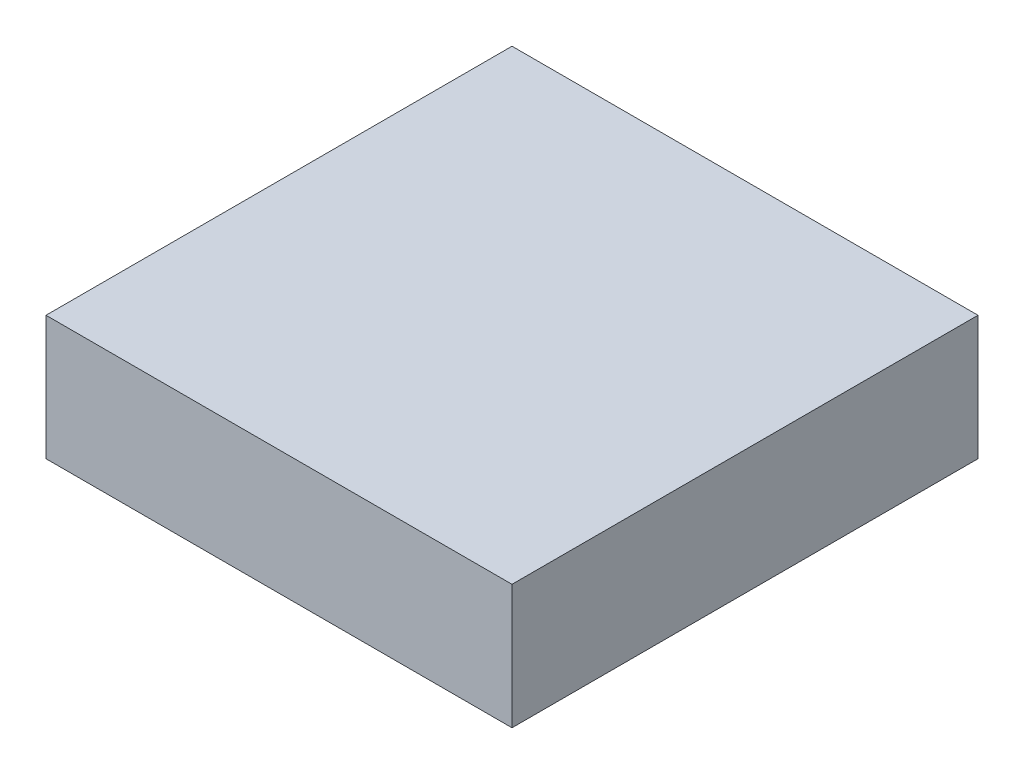
ISO-10303-21;
HEADER;
FILE_DESCRIPTION(('STEP AP214'),'2;1');
FILE_NAME('part.step','',(''),(''),'','','');
FILE_SCHEMA(('AUTOMOTIVE_DESIGN { 1 0 10303 214 1 1 1 1 }'));
ENDSEC;
DATA;
#1=APPLICATION_CONTEXT('core data for automotive mechanical design processes');
#2=APPLICATION_PROTOCOL_DEFINITION('international standard','automotive_design',2000,#1);
#3=PRODUCT_CONTEXT('',#1,'mechanical');
#4=PRODUCT('Part','Part','',(#3));
#5=PRODUCT_RELATED_PRODUCT_CATEGORY('part','',(#4));
#6=PRODUCT_DEFINITION_FORMATION('','',#4);
#7=PRODUCT_DEFINITION_CONTEXT('part definition',#1,'design');
#8=PRODUCT_DEFINITION('design','',#6,#7);
#9=PRODUCT_DEFINITION_SHAPE('','',#8);
#10=(LENGTH_UNIT() NAMED_UNIT(*) SI_UNIT(.MILLI.,.METRE.));
#11=(NAMED_UNIT(*) PLANE_ANGLE_UNIT() SI_UNIT($,.RADIAN.));
#12=(NAMED_UNIT(*) SI_UNIT($,.STERADIAN.) SOLID_ANGLE_UNIT());
#13=UNCERTAINTY_MEASURE_WITH_UNIT(LENGTH_MEASURE(1.E-05),#10,'distance_accuracy_value','');
#14=(GEOMETRIC_REPRESENTATION_CONTEXT(3) GLOBAL_UNCERTAINTY_ASSIGNED_CONTEXT((#13)) GLOBAL_UNIT_ASSIGNED_CONTEXT((#10,
#11,#12)) REPRESENTATION_CONTEXT('',''));
#15=CARTESIAN_POINT('',(0.,0.,0.));
#16=DIRECTION('',(0.,0.,1.));
#17=DIRECTION('',(1.,0.,0.));
#18=AXIS2_PLACEMENT_3D('',#15,#16,#17);
#19=CARTESIAN_POINT('',(-102.21172452655,20.,-48.8032705742084));
#20=DIRECTION('',(1.,0.,0.));
#21=DIRECTION('',(0.,0.,-1.));
#22=AXIS2_PLACEMENT_3D('',#19,#20,#21);
#23=PLANE('',#22);
#24=DIRECTION('',(0.,0.,1.));
#25=VECTOR('',#24,1.);
#26=CARTESIAN_POINT('',(-102.21172452655,0.,-48.8032705742084));
#27=LINE('',#26,#25);
#28=CARTESIAN_POINT('',(-102.21172452655,0.,-48.8032705742084));
#29=VERTEX_POINT('',#28);
#30=CARTESIAN_POINT('',(-102.21172452655,0.,26.1967294257916));
#31=VERTEX_POINT('',#30);
#32=EDGE_CURVE('E97',#29,#31,#27,.T.);
#33=ORIENTED_EDGE('',*,*,#32,.T.);
#34=DIRECTION('',(0.,-1.,0.));
#35=VECTOR('',#34,1.);
#36=CARTESIAN_POINT('',(-102.21172452655,20.,26.1967294257916));
#37=LINE('',#36,#35);
#38=CARTESIAN_POINT('',(-102.21172452655,20.,26.1967294257916));
#39=VERTEX_POINT('',#38);
#40=EDGE_CURVE('E11',#39,#31,#37,.T.);
#41=ORIENTED_EDGE('',*,*,#40,.F.);
#42=DIRECTION('',(0.,0.,1.));
#43=VECTOR('',#42,1.);
#44=CARTESIAN_POINT('',(-102.21172452655,20.,-48.8032705742084));
#45=LINE('',#44,#43);
#46=CARTESIAN_POINT('',(-102.21172452655,20.,-48.8032705742084));
#47=VERTEX_POINT('',#46);
#48=EDGE_CURVE('E85',#47,#39,#45,.T.);
#49=ORIENTED_EDGE('',*,*,#48,.F.);
#50=DIRECTION('',(0.,-1.,0.));
#51=VECTOR('',#50,1.);
#52=CARTESIAN_POINT('',(-102.21172452655,20.,-48.8032705742084));
#53=LINE('',#52,#51);
#54=EDGE_CURVE('E93',#47,#29,#53,.T.);
#55=ORIENTED_EDGE('',*,*,#54,.T.);
#56=EDGE_LOOP('',(#33,#41,#49,#55));
#57=FACE_BOUND('',#56,.T.);
#58=ADVANCED_FACE('F34',(#57),#23,.F.);
#59=CARTESIAN_POINT('',(-102.21172452655,20.,26.1967294257916));
#60=DIRECTION('',(0.,0.,-1.));
#61=DIRECTION('',(-1.,0.,0.));
#62=AXIS2_PLACEMENT_3D('',#59,#60,#61);
#63=PLANE('',#62);
#64=DIRECTION('',(1.,0.,0.));
#65=VECTOR('',#64,1.);
#66=CARTESIAN_POINT('',(-102.21172452655,0.,26.1967294257916));
#67=LINE('',#66,#65);
#68=CARTESIAN_POINT('',(-27.2117245265495,0.,26.1967294257916));
#69=VERTEX_POINT('',#68);
#70=EDGE_CURVE('E89',#31,#69,#67,.T.);
#71=ORIENTED_EDGE('',*,*,#70,.T.);
#72=DIRECTION('',(0.,-1.,0.));
#73=VECTOR('',#72,1.);
#74=CARTESIAN_POINT('',(-27.2117245265495,20.,26.1967294257916));
#75=LINE('',#74,#73);
#76=CARTESIAN_POINT('',(-27.2117245265495,20.,26.1967294257916));
#77=VERTEX_POINT('',#76);
#78=EDGE_CURVE('E42',#77,#69,#75,.T.);
#79=ORIENTED_EDGE('',*,*,#78,.F.);
#80=DIRECTION('',(1.,0.,0.));
#81=VECTOR('',#80,1.);
#82=CARTESIAN_POINT('',(-102.21172452655,20.,26.1967294257916));
#83=LINE('',#82,#81);
#84=EDGE_CURVE('E80',#39,#77,#83,.T.);
#85=ORIENTED_EDGE('',*,*,#84,.F.);
#86=ORIENTED_EDGE('',*,*,#40,.T.);
#87=EDGE_LOOP('',(#71,#79,#85,#86));
#88=FACE_BOUND('',#87,.T.);
#89=ADVANCED_FACE('F88',(#88),#63,.F.);
#90=CARTESIAN_POINT('',(-27.2117245265495,20.,-48.8032705742084));
#91=DIRECTION('',(-1.,0.,0.));
#92=DIRECTION('',(0.,0.,1.));
#93=AXIS2_PLACEMENT_3D('',#90,#91,#92);
#94=PLANE('',#93);
#95=DIRECTION('',(0.,0.,-1.));
#96=VECTOR('',#95,1.);
#97=CARTESIAN_POINT('',(-27.2117245265495,0.,-48.8032705742084));
#98=LINE('',#97,#96);
#99=CARTESIAN_POINT('',(-27.2117245265495,0.,-48.8032705742084));
#100=VERTEX_POINT('',#99);
#101=EDGE_CURVE('E67',#69,#100,#98,.T.);
#102=ORIENTED_EDGE('',*,*,#101,.T.);
#103=DIRECTION('',(0.,-1.,0.));
#104=VECTOR('',#103,1.);
#105=CARTESIAN_POINT('',(-27.2117245265495,20.,-48.8032705742084));
#106=LINE('',#105,#104);
#107=CARTESIAN_POINT('',(-27.2117245265495,20.,-48.8032705742084));
#108=VERTEX_POINT('',#107);
#109=EDGE_CURVE('E90',#108,#100,#106,.T.);
#110=ORIENTED_EDGE('',*,*,#109,.F.);
#111=DIRECTION('',(0.,0.,-1.));
#112=VECTOR('',#111,1.);
#113=CARTESIAN_POINT('',(-27.2117245265495,20.,-48.8032705742084));
#114=LINE('',#113,#112);
#115=EDGE_CURVE('E83',#77,#108,#114,.T.);
#116=ORIENTED_EDGE('',*,*,#115,.F.);
#117=ORIENTED_EDGE('',*,*,#78,.T.);
#118=EDGE_LOOP('',(#102,#110,#116,#117));
#119=FACE_BOUND('',#118,.T.);
#120=ADVANCED_FACE('F91',(#119),#94,.F.);
#121=CARTESIAN_POINT('',(-102.21172452655,20.,-48.8032705742084));
#122=DIRECTION('',(0.,0.,1.));
#123=DIRECTION('',(1.,0.,0.));
#124=AXIS2_PLACEMENT_3D('',#121,#122,#123);
#125=PLANE('',#124);
#126=DIRECTION('',(-1.,0.,0.));
#127=VECTOR('',#126,1.);
#128=CARTESIAN_POINT('',(-102.21172452655,0.,-48.8032705742084));
#129=LINE('',#128,#127);
#130=EDGE_CURVE('E73',#100,#29,#129,.T.);
#131=ORIENTED_EDGE('',*,*,#130,.T.);
#132=ORIENTED_EDGE('',*,*,#54,.F.);
#133=DIRECTION('',(-1.,0.,0.));
#134=VECTOR('',#133,1.);
#135=CARTESIAN_POINT('',(-102.21172452655,20.,-48.8032705742084));
#136=LINE('',#135,#134);
#137=EDGE_CURVE('E50',#108,#47,#136,.T.);
#138=ORIENTED_EDGE('',*,*,#137,.F.);
#139=ORIENTED_EDGE('',*,*,#109,.T.);
#140=EDGE_LOOP('',(#131,#132,#138,#139));
#141=FACE_BOUND('',#140,.T.);
#142=ADVANCED_FACE('F104',(#141),#125,.F.);
#143=CARTESIAN_POINT('',(0.,20.,0.));
#144=DIRECTION('',(0.,1.,0.));
#145=DIRECTION('',(0.,0.,1.));
#146=AXIS2_PLACEMENT_3D('',#143,#144,#145);
#147=PLANE('',#146);
#148=ORIENTED_EDGE('',*,*,#48,.T.);
#149=ORIENTED_EDGE('',*,*,#84,.T.);
#150=ORIENTED_EDGE('',*,*,#115,.T.);
#151=ORIENTED_EDGE('',*,*,#137,.T.);
#152=EDGE_LOOP('',(#148,#149,#150,#151));
#153=FACE_BOUND('',#152,.T.);
#154=ADVANCED_FACE('F81',(#153),#147,.T.);
#155=CARTESIAN_POINT('',(0.,0.,0.));
#156=DIRECTION('',(0.,1.,0.));
#157=DIRECTION('',(0.,0.,1.));
#158=AXIS2_PLACEMENT_3D('',#155,#156,#157);
#159=PLANE('',#158);
#160=ORIENTED_EDGE('',*,*,#32,.F.);
#161=ORIENTED_EDGE('',*,*,#130,.F.);
#162=ORIENTED_EDGE('',*,*,#101,.F.);
#163=ORIENTED_EDGE('',*,*,#70,.F.);
#164=EDGE_LOOP('',(#160,#161,#162,#163));
#165=FACE_BOUND('',#164,.T.);
#166=ADVANCED_FACE('F107',(#165),#159,.F.);
#167=CLOSED_SHELL('',(#58,#89,#120,#142,#154,#166));
#168=MANIFOLD_SOLID_BREP('B2',#167);
#169=ADVANCED_BREP_SHAPE_REPRESENTATION('',(#18,#168),#14);
#170=SHAPE_DEFINITION_REPRESENTATION(#9,#169);
ENDSEC;
END-ISO-10303-21;
